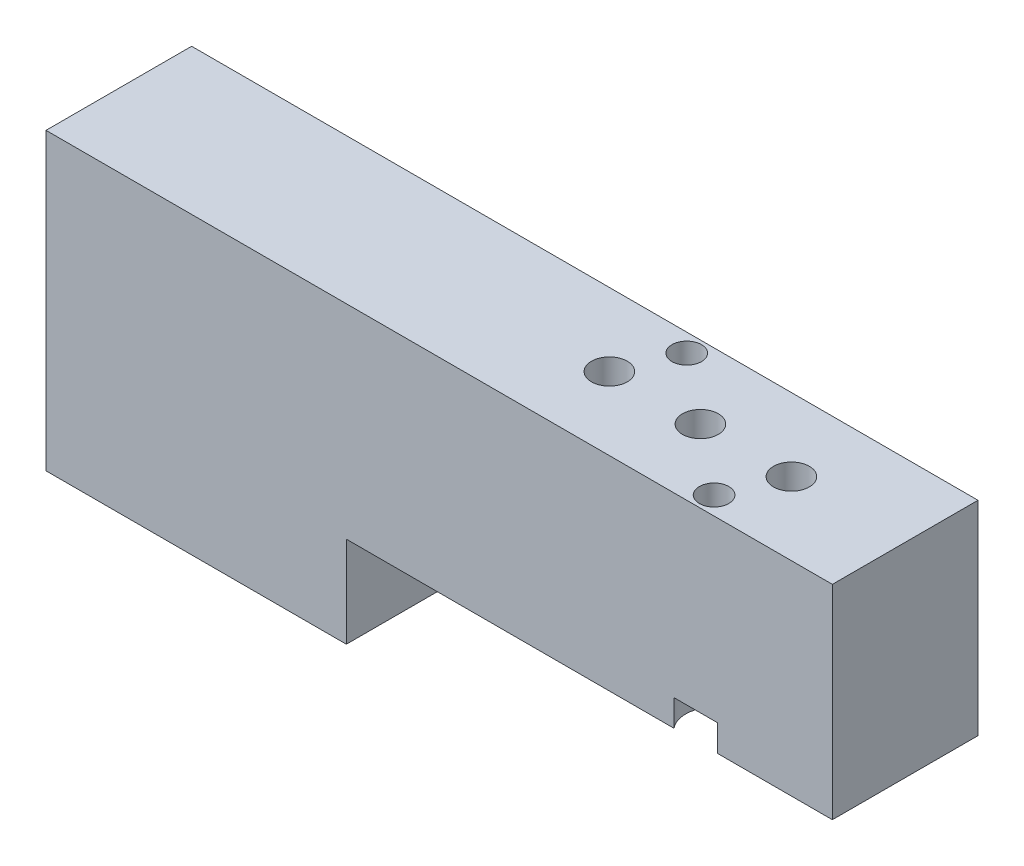
ISO-10303-21;
HEADER;
FILE_DESCRIPTION(('STEP AP214'),'2;1');
FILE_NAME('part.step','',(''),(''),'','','');
FILE_SCHEMA(('AUTOMOTIVE_DESIGN { 1 0 10303 214 1 1 1 1 }'));
ENDSEC;
DATA;
#1=APPLICATION_CONTEXT('core data for automotive mechanical design processes');
#2=APPLICATION_PROTOCOL_DEFINITION('international standard','automotive_design',2000,#1);
#3=PRODUCT_CONTEXT('',#1,'mechanical');
#4=PRODUCT('Part','Part','',(#3));
#5=PRODUCT_RELATED_PRODUCT_CATEGORY('part','',(#4));
#6=PRODUCT_DEFINITION_FORMATION('','',#4);
#7=PRODUCT_DEFINITION_CONTEXT('part definition',#1,'design');
#8=PRODUCT_DEFINITION('design','',#6,#7);
#9=PRODUCT_DEFINITION_SHAPE('','',#8);
#10=(LENGTH_UNIT() NAMED_UNIT(*) SI_UNIT(.MILLI.,.METRE.));
#11=(NAMED_UNIT(*) PLANE_ANGLE_UNIT() SI_UNIT($,.RADIAN.));
#12=(NAMED_UNIT(*) SI_UNIT($,.STERADIAN.) SOLID_ANGLE_UNIT());
#13=UNCERTAINTY_MEASURE_WITH_UNIT(LENGTH_MEASURE(1.E-05),#10,'distance_accuracy_value','');
#14=(GEOMETRIC_REPRESENTATION_CONTEXT(3) GLOBAL_UNCERTAINTY_ASSIGNED_CONTEXT((#13)) GLOBAL_UNIT_ASSIGNED_CONTEXT((#10,
#11,#12)) REPRESENTATION_CONTEXT('',''));
#15=CARTESIAN_POINT('',(0.,0.,0.));
#16=DIRECTION('',(0.,0.,1.));
#17=DIRECTION('',(1.,0.,0.));
#18=AXIS2_PLACEMENT_3D('',#15,#16,#17);
#19=CARTESIAN_POINT('',(0.,0.,-10.16));
#20=DIRECTION('',(-1.,0.,0.));
#21=DIRECTION('',(0.,0.,1.));
#22=AXIS2_PLACEMENT_3D('',#19,#20,#21);
#23=PLANE('',#22);
#24=DIRECTION('',(0.,-1.,0.));
#25=VECTOR('',#24,1.);
#26=CARTESIAN_POINT('',(0.,0.,0.));
#27=LINE('',#26,#25);
#28=CARTESIAN_POINT('',(0.,14.224,0.));
#29=VERTEX_POINT('',#28);
#30=CARTESIAN_POINT('',(0.,-6.35,0.));
#31=VERTEX_POINT('',#30);
#32=EDGE_CURVE('E195',#29,#31,#27,.T.);
#33=ORIENTED_EDGE('',*,*,#32,.F.);
#34=DIRECTION('',(0.,0.,1.));
#35=VECTOR('',#34,1.);
#36=CARTESIAN_POINT('',(0.,14.224,-10.16));
#37=LINE('',#36,#35);
#38=CARTESIAN_POINT('',(0.,14.224,-10.16));
#39=VERTEX_POINT('',#38);
#40=EDGE_CURVE('E215',#39,#29,#37,.T.);
#41=ORIENTED_EDGE('',*,*,#40,.F.);
#42=DIRECTION('',(0.,-1.,0.));
#43=VECTOR('',#42,1.);
#44=CARTESIAN_POINT('',(0.,0.,-10.16));
#45=LINE('',#44,#43);
#46=CARTESIAN_POINT('',(0.,-6.35,-10.16));
#47=VERTEX_POINT('',#46);
#48=EDGE_CURVE('E200',#39,#47,#45,.T.);
#49=ORIENTED_EDGE('',*,*,#48,.T.);
#50=DIRECTION('',(0.,0.,-1.));
#51=VECTOR('',#50,1.);
#52=CARTESIAN_POINT('',(0.,-6.35,0.));
#53=LINE('',#52,#51);
#54=EDGE_CURVE('E177',#31,#47,#53,.T.);
#55=ORIENTED_EDGE('',*,*,#54,.F.);
#56=EDGE_LOOP('',(#33,#41,#49,#55));
#57=FACE_BOUND('',#56,.T.);
#58=ADVANCED_FACE('F33',(#57),#23,.T.);
#59=CARTESIAN_POINT('',(0.,14.224,-10.16));
#60=DIRECTION('',(0.,1.,0.));
#61=DIRECTION('',(-1.,0.,0.));
#62=AXIS2_PLACEMENT_3D('',#59,#60,#61);
#63=PLANE('',#62);
#64=CARTESIAN_POINT('',(45.339,14.224,-1.27));
#65=DIRECTION('',(0.,1.,0.));
#66=DIRECTION('',(-1.,0.,0.));
#67=AXIS2_PLACEMENT_3D('',#64,#65,#66);
#68=CIRCLE('',#67,1.02869999999999);
#69=CARTESIAN_POINT('',(44.3103,14.224,-1.27));
#70=VERTEX_POINT('',#69);
#71=EDGE_CURVE('E36',#70,#70,#68,.T.);
#72=ORIENTED_EDGE('',*,*,#71,.F.);
#73=EDGE_LOOP('',(#72));
#74=FACE_BOUND('',#73,.T.);
#75=CARTESIAN_POINT('',(35.814,14.224,-8.89));
#76=DIRECTION('',(0.,1.,0.));
#77=DIRECTION('',(-1.,0.,0.));
#78=AXIS2_PLACEMENT_3D('',#75,#76,#77);
#79=CIRCLE('',#78,1.02869999999999);
#80=CARTESIAN_POINT('',(34.7853,14.224,-8.89));
#81=VERTEX_POINT('',#80);
#82=EDGE_CURVE('E155',#81,#81,#79,.T.);
#83=ORIENTED_EDGE('',*,*,#82,.F.);
#84=EDGE_LOOP('',(#83));
#85=FACE_BOUND('',#84,.T.);
#86=CARTESIAN_POINT('',(46.9265,14.224,-5.08));
#87=DIRECTION('',(0.,1.,0.));
#88=DIRECTION('',(0.,0.,1.));
#89=AXIS2_PLACEMENT_3D('',#86,#87,#88);
#90=CIRCLE('',#89,1.25);
#91=CARTESIAN_POINT('',(46.9265,14.224,-3.83));
#92=VERTEX_POINT('',#91);
#93=EDGE_CURVE('E159',#92,#92,#90,.T.);
#94=ORIENTED_EDGE('',*,*,#93,.F.);
#95=EDGE_LOOP('',(#94));
#96=FACE_BOUND('',#95,.T.);
#97=CARTESIAN_POINT('',(40.5765,14.224,-5.08));
#98=DIRECTION('',(0.,1.,0.));
#99=DIRECTION('',(0.,0.,1.));
#100=AXIS2_PLACEMENT_3D('',#97,#98,#99);
#101=CIRCLE('',#100,1.25);
#102=CARTESIAN_POINT('',(40.5765,14.224,-3.83));
#103=VERTEX_POINT('',#102);
#104=EDGE_CURVE('E165',#103,#103,#101,.T.);
#105=ORIENTED_EDGE('',*,*,#104,.F.);
#106=EDGE_LOOP('',(#105));
#107=FACE_BOUND('',#106,.T.);
#108=CARTESIAN_POINT('',(34.2265,14.224,-5.08));
#109=DIRECTION('',(0.,1.,0.));
#110=DIRECTION('',(0.,0.,1.));
#111=AXIS2_PLACEMENT_3D('',#108,#109,#110);
#112=CIRCLE('',#111,1.25);
#113=CARTESIAN_POINT('',(34.2265,14.224,-3.83));
#114=VERTEX_POINT('',#113);
#115=EDGE_CURVE('E171',#114,#114,#112,.T.);
#116=ORIENTED_EDGE('',*,*,#115,.F.);
#117=EDGE_LOOP('',(#116));
#118=FACE_BOUND('',#117,.T.);
#119=DIRECTION('',(-1.,0.,0.));
#120=VECTOR('',#119,1.);
#121=CARTESIAN_POINT('',(0.,14.224,0.));
#122=LINE('',#121,#120);
#123=CARTESIAN_POINT('',(54.864,14.224,0.));
#124=VERTEX_POINT('',#123);
#125=EDGE_CURVE('E252',#124,#29,#122,.T.);
#126=ORIENTED_EDGE('',*,*,#125,.F.);
#127=DIRECTION('',(0.,0.,1.));
#128=VECTOR('',#127,1.);
#129=CARTESIAN_POINT('',(54.864,14.224,-10.16));
#130=LINE('',#129,#128);
#131=CARTESIAN_POINT('',(54.864,14.224,-10.16));
#132=VERTEX_POINT('',#131);
#133=EDGE_CURVE('E217',#132,#124,#130,.T.);
#134=ORIENTED_EDGE('',*,*,#133,.F.);
#135=DIRECTION('',(-1.,0.,0.));
#136=VECTOR('',#135,1.);
#137=CARTESIAN_POINT('',(0.,14.224,-10.16));
#138=LINE('',#137,#136);
#139=EDGE_CURVE('E211',#132,#39,#138,.T.);
#140=ORIENTED_EDGE('',*,*,#139,.T.);
#141=ORIENTED_EDGE('',*,*,#40,.T.);
#142=EDGE_LOOP('',(#126,#134,#140,#141));
#143=FACE_BOUND('',#142,.T.);
#144=ADVANCED_FACE('F255',(#74,#85,#96,#107,#118,#143),#63,.T.);
#145=CARTESIAN_POINT('',(54.864,0.,-10.16));
#146=DIRECTION('',(1.,0.,0.));
#147=DIRECTION('',(0.,0.,-1.));
#148=AXIS2_PLACEMENT_3D('',#145,#146,#147);
#149=PLANE('',#148);
#150=DIRECTION('',(0.,1.,0.));
#151=VECTOR('',#150,1.);
#152=CARTESIAN_POINT('',(54.864,0.,0.));
#153=LINE('',#152,#151);
#154=CARTESIAN_POINT('',(54.864,0.,0.));
#155=VERTEX_POINT('',#154);
#156=EDGE_CURVE('E223',#155,#124,#153,.T.);
#157=ORIENTED_EDGE('',*,*,#156,.F.);
#158=DIRECTION('',(0.,0.,1.));
#159=VECTOR('',#158,1.);
#160=CARTESIAN_POINT('',(54.864,0.,-10.16));
#161=LINE('',#160,#159);
#162=CARTESIAN_POINT('',(54.864,0.,-10.16));
#163=VERTEX_POINT('',#162);
#164=EDGE_CURVE('E214',#163,#155,#161,.T.);
#165=ORIENTED_EDGE('',*,*,#164,.F.);
#166=DIRECTION('',(0.,1.,0.));
#167=VECTOR('',#166,1.);
#168=CARTESIAN_POINT('',(54.864,0.,-10.16));
#169=LINE('',#168,#167);
#170=EDGE_CURVE('E207',#163,#132,#169,.T.);
#171=ORIENTED_EDGE('',*,*,#170,.T.);
#172=ORIENTED_EDGE('',*,*,#133,.T.);
#173=EDGE_LOOP('',(#157,#165,#171,#172));
#174=FACE_BOUND('',#173,.T.);
#175=ADVANCED_FACE('F290',(#174),#149,.T.);
#176=CARTESIAN_POINT('',(0.,0.,-10.16));
#177=DIRECTION('',(0.,-1.,0.));
#178=DIRECTION('',(0.,0.,-1.));
#179=AXIS2_PLACEMENT_3D('',#176,#177,#178);
#180=PLANE('',#179);
#181=CARTESIAN_POINT('',(43.7642,0.,-6.985));
#182=DIRECTION('',(0.,-1.,0.));
#183=DIRECTION('',(0.,0.,-1.));
#184=AXIS2_PLACEMENT_3D('',#181,#182,#183);
#185=CIRCLE('',#184,1.24999999999999);
#186=CARTESIAN_POINT('',(43.7642,0.,-8.23499999999999));
#187=VERTEX_POINT('',#186);
#188=EDGE_CURVE('E132',#187,#187,#185,.T.);
#189=ORIENTED_EDGE('',*,*,#188,.F.);
#190=EDGE_LOOP('',(#189));
#191=FACE_BOUND('',#190,.T.);
#192=CARTESIAN_POINT('',(37.4142,0.,-3.175));
#193=DIRECTION('',(0.,-1.,0.));
#194=DIRECTION('',(0.,0.,-1.));
#195=AXIS2_PLACEMENT_3D('',#192,#193,#194);
#196=CIRCLE('',#195,1.24999999999999);
#197=CARTESIAN_POINT('',(37.4142,0.,-4.42499999999999));
#198=VERTEX_POINT('',#197);
#199=EDGE_CURVE('E140',#198,#198,#196,.T.);
#200=ORIENTED_EDGE('',*,*,#199,.F.);
#201=EDGE_LOOP('',(#200));
#202=FACE_BOUND('',#201,.T.);
#203=CARTESIAN_POINT('',(45.339,0.,-1.27));
#204=DIRECTION('',(0.,-1.,0.));
#205=DIRECTION('',(0.,0.,-1.));
#206=AXIS2_PLACEMENT_3D('',#203,#204,#205);
#207=CIRCLE('',#206,1.98501);
#208=CARTESIAN_POINT('',(43.8134297131564,0.,0.));
#209=VERTEX_POINT('',#208);
#210=CARTESIAN_POINT('',(46.8645702868436,0.,0.));
#211=VERTEX_POINT('',#210);
#212=EDGE_CURVE('E147',#209,#211,#207,.T.);
#213=ORIENTED_EDGE('',*,*,#212,.F.);
#214=DIRECTION('',(1.,0.,0.));
#215=VECTOR('',#214,1.);
#216=CARTESIAN_POINT('',(0.,0.,0.));
#217=LINE('',#216,#215);
#218=CARTESIAN_POINT('',(20.955,0.,0.));
#219=VERTEX_POINT('',#218);
#220=EDGE_CURVE('E220',#219,#209,#217,.T.);
#221=ORIENTED_EDGE('',*,*,#220,.F.);
#222=DIRECTION('',(0.,0.,1.));
#223=VECTOR('',#222,1.);
#224=CARTESIAN_POINT('',(20.955,0.,0.));
#225=LINE('',#224,#223);
#226=CARTESIAN_POINT('',(20.955,0.,-10.16));
#227=VERTEX_POINT('',#226);
#228=EDGE_CURVE('E174',#227,#219,#225,.T.);
#229=ORIENTED_EDGE('',*,*,#228,.F.);
#230=DIRECTION('',(1.,0.,0.));
#231=VECTOR('',#230,1.);
#232=CARTESIAN_POINT('',(0.,0.,-10.16));
#233=LINE('',#232,#231);
#234=CARTESIAN_POINT('',(34.2884297131564,0.,-10.16));
#235=VERTEX_POINT('',#234);
#236=EDGE_CURVE('E183',#227,#235,#233,.T.);
#237=ORIENTED_EDGE('',*,*,#236,.T.);
#238=CARTESIAN_POINT('',(35.814,0.,-8.89));
#239=DIRECTION('',(0.,-1.,0.));
#240=DIRECTION('',(0.,0.,-1.));
#241=AXIS2_PLACEMENT_3D('',#238,#239,#240);
#242=CIRCLE('',#241,1.98501);
#243=CARTESIAN_POINT('',(37.3395702868436,0.,-10.16));
#244=VERTEX_POINT('',#243);
#245=EDGE_CURVE('E153',#244,#235,#242,.T.);
#246=ORIENTED_EDGE('',*,*,#245,.F.);
#247=EDGE_CURVE('E198',#244,#163,#233,.T.);
#248=ORIENTED_EDGE('',*,*,#247,.T.);
#249=ORIENTED_EDGE('',*,*,#164,.T.);
#250=EDGE_CURVE('E224',#211,#155,#217,.T.);
#251=ORIENTED_EDGE('',*,*,#250,.F.);
#252=EDGE_LOOP('',(#213,#221,#229,#237,#246,#248,#249,#251));
#253=FACE_BOUND('',#252,.T.);
#254=ADVANCED_FACE('F246',(#191,#202,#253),#180,.T.);
#255=CARTESIAN_POINT('',(0.,0.,-10.16));
#256=DIRECTION('',(0.,0.,-1.));
#257=DIRECTION('',(-1.,0.,0.));
#258=AXIS2_PLACEMENT_3D('',#255,#256,#257);
#259=PLANE('',#258);
#260=DIRECTION('',(0.,-1.,0.));
#261=VECTOR('',#260,1.);
#262=CARTESIAN_POINT('',(37.3395702868436,0.,-10.16));
#263=LINE('',#262,#261);
#264=CARTESIAN_POINT('',(37.3395702868436,1.8542,-10.16));
#265=VERTEX_POINT('',#264);
#266=EDGE_CURVE('E237',#265,#244,#263,.T.);
#267=ORIENTED_EDGE('',*,*,#266,.F.);
#268=DIRECTION('',(1.,0.,0.));
#269=VECTOR('',#268,1.);
#270=CARTESIAN_POINT('',(0.,1.8542,-10.16));
#271=LINE('',#270,#269);
#272=CARTESIAN_POINT('',(34.2884297131564,1.8542,-10.16));
#273=VERTEX_POINT('',#272);
#274=EDGE_CURVE('E201',#273,#265,#271,.T.);
#275=ORIENTED_EDGE('',*,*,#274,.F.);
#276=DIRECTION('',(0.,-1.,0.));
#277=VECTOR('',#276,1.);
#278=CARTESIAN_POINT('',(34.2884297131564,0.,-10.16));
#279=LINE('',#278,#277);
#280=EDGE_CURVE('E283',#235,#273,#279,.F.);
#281=ORIENTED_EDGE('',*,*,#280,.F.);
#282=ORIENTED_EDGE('',*,*,#236,.F.);
#283=DIRECTION('',(0.,1.,0.));
#284=VECTOR('',#283,1.);
#285=CARTESIAN_POINT('',(20.955,-6.35,-10.16));
#286=LINE('',#285,#284);
#287=CARTESIAN_POINT('',(20.955,-6.35,-10.16));
#288=VERTEX_POINT('',#287);
#289=EDGE_CURVE('E189',#288,#227,#286,.T.);
#290=ORIENTED_EDGE('',*,*,#289,.F.);
#291=DIRECTION('',(1.,0.,0.));
#292=VECTOR('',#291,1.);
#293=CARTESIAN_POINT('',(0.,-6.35,-10.16));
#294=LINE('',#293,#292);
#295=EDGE_CURVE('E265',#47,#288,#294,.T.);
#296=ORIENTED_EDGE('',*,*,#295,.F.);
#297=ORIENTED_EDGE('',*,*,#48,.F.);
#298=ORIENTED_EDGE('',*,*,#139,.F.);
#299=ORIENTED_EDGE('',*,*,#170,.F.);
#300=ORIENTED_EDGE('',*,*,#247,.F.);
#301=EDGE_LOOP('',(#267,#275,#281,#282,#290,#296,#297,#298,#299,#300));
#302=FACE_BOUND('',#301,.T.);
#303=ADVANCED_FACE('F267',(#302),#259,.T.);
#304=CARTESIAN_POINT('',(0.,0.,0.));
#305=DIRECTION('',(0.,0.,-1.));
#306=DIRECTION('',(-1.,0.,0.));
#307=AXIS2_PLACEMENT_3D('',#304,#305,#306);
#308=PLANE('',#307);
#309=DIRECTION('',(1.,0.,0.));
#310=VECTOR('',#309,1.);
#311=CARTESIAN_POINT('',(0.,1.8542,0.));
#312=LINE('',#311,#310);
#313=CARTESIAN_POINT('',(43.8134297131564,1.8542,0.));
#314=VERTEX_POINT('',#313);
#315=CARTESIAN_POINT('',(46.8645702868436,1.8542,0.));
#316=VERTEX_POINT('',#315);
#317=EDGE_CURVE('E234',#314,#316,#312,.T.);
#318=ORIENTED_EDGE('',*,*,#317,.T.);
#319=DIRECTION('',(0.,-1.,0.));
#320=VECTOR('',#319,1.);
#321=CARTESIAN_POINT('',(46.8645702868436,0.,0.));
#322=LINE('',#321,#320);
#323=EDGE_CURVE('E11',#316,#211,#322,.T.);
#324=ORIENTED_EDGE('',*,*,#323,.T.);
#325=ORIENTED_EDGE('',*,*,#250,.T.);
#326=ORIENTED_EDGE('',*,*,#156,.T.);
#327=ORIENTED_EDGE('',*,*,#125,.T.);
#328=ORIENTED_EDGE('',*,*,#32,.T.);
#329=DIRECTION('',(-1.,0.,0.));
#330=VECTOR('',#329,1.);
#331=CARTESIAN_POINT('',(0.,-6.35,0.));
#332=LINE('',#331,#330);
#333=CARTESIAN_POINT('',(20.955,-6.35,0.));
#334=VERTEX_POINT('',#333);
#335=EDGE_CURVE('E190',#334,#31,#332,.T.);
#336=ORIENTED_EDGE('',*,*,#335,.F.);
#337=DIRECTION('',(0.,1.,0.));
#338=VECTOR('',#337,1.);
#339=CARTESIAN_POINT('',(20.955,-6.35,0.));
#340=LINE('',#339,#338);
#341=EDGE_CURVE('E186',#334,#219,#340,.T.);
#342=ORIENTED_EDGE('',*,*,#341,.T.);
#343=ORIENTED_EDGE('',*,*,#220,.T.);
#344=DIRECTION('',(0.,-1.,0.));
#345=VECTOR('',#344,1.);
#346=CARTESIAN_POINT('',(43.8134297131564,0.,0.));
#347=LINE('',#346,#345);
#348=EDGE_CURVE('E41',#209,#314,#347,.F.);
#349=ORIENTED_EDGE('',*,*,#348,.T.);
#350=EDGE_LOOP('',(#318,#324,#325,#326,#327,#328,#336,#342,#343,#349));
#351=FACE_BOUND('',#350,.T.);
#352=ADVANCED_FACE('F240',(#351),#308,.F.);
#353=CARTESIAN_POINT('',(20.955,-6.35,0.));
#354=DIRECTION('',(-1.,0.,0.));
#355=DIRECTION('',(0.,0.,1.));
#356=AXIS2_PLACEMENT_3D('',#353,#354,#355);
#357=PLANE('',#356);
#358=ORIENTED_EDGE('',*,*,#228,.T.);
#359=ORIENTED_EDGE('',*,*,#341,.F.);
#360=DIRECTION('',(0.,0.,1.));
#361=VECTOR('',#360,1.);
#362=CARTESIAN_POINT('',(20.955,-6.35,0.));
#363=LINE('',#362,#361);
#364=EDGE_CURVE('E271',#288,#334,#363,.T.);
#365=ORIENTED_EDGE('',*,*,#364,.F.);
#366=ORIENTED_EDGE('',*,*,#289,.T.);
#367=EDGE_LOOP('',(#358,#359,#365,#366));
#368=FACE_BOUND('',#367,.T.);
#369=ADVANCED_FACE('F278',(#368),#357,.F.);
#370=CARTESIAN_POINT('',(0.,-6.35,-10.16));
#371=DIRECTION('',(0.,-1.,0.));
#372=DIRECTION('',(0.,0.,-1.));
#373=AXIS2_PLACEMENT_3D('',#370,#371,#372);
#374=PLANE('',#373);
#375=ORIENTED_EDGE('',*,*,#54,.T.);
#376=ORIENTED_EDGE('',*,*,#295,.T.);
#377=ORIENTED_EDGE('',*,*,#364,.T.);
#378=ORIENTED_EDGE('',*,*,#335,.T.);
#379=EDGE_LOOP('',(#375,#376,#377,#378));
#380=FACE_BOUND('',#379,.T.);
#381=ADVANCED_FACE('F273',(#380),#374,.T.);
#382=CARTESIAN_POINT('',(34.2265,14.224,-5.08));
#383=DIRECTION('',(0.,1.,0.));
#384=DIRECTION('',(0.,0.,1.));
#385=AXIS2_PLACEMENT_3D('',#382,#383,#384);
#386=CYLINDRICAL_SURFACE('',#385,1.25);
#387=CARTESIAN_POINT('',(34.2265,6.724015,-5.08));
#388=DIRECTION('',(0.,1.,0.));
#389=DIRECTION('',(0.,0.,1.));
#390=AXIS2_PLACEMENT_3D('',#387,#388,#389);
#391=CIRCLE('',#390,1.25);
#392=CARTESIAN_POINT('',(34.2265,6.724015,-3.83));
#393=VERTEX_POINT('',#392);
#394=EDGE_CURVE('E168',#393,#393,#391,.T.);
#395=ORIENTED_EDGE('',*,*,#394,.F.);
#396=EDGE_LOOP('',(#395));
#397=FACE_BOUND('',#396,.T.);
#398=ORIENTED_EDGE('',*,*,#115,.T.);
#399=EDGE_LOOP('',(#398));
#400=FACE_BOUND('',#399,.T.);
#401=ADVANCED_FACE('F319',(#397,#400),#386,.F.);
#402=CARTESIAN_POINT('',(34.2265,6.724015,-5.08));
#403=DIRECTION('',(0.,1.,0.));
#404=DIRECTION('',(0.,0.,1.));
#405=AXIS2_PLACEMENT_3D('',#402,#403,#404);
#406=CONICAL_SURFACE('',#405,1.25,1.02974425867665);
#407=CARTESIAN_POINT('',(34.2265,5.97293922621555,-5.08));
#408=VERTEX_POINT('',#407);
#409=VERTEX_LOOP('',#408);
#410=FACE_BOUND('',#409,.T.);
#411=ORIENTED_EDGE('',*,*,#394,.T.);
#412=EDGE_LOOP('',(#411));
#413=FACE_BOUND('',#412,.T.);
#414=ADVANCED_FACE('F327',(#410,#413),#406,.F.);
#415=CARTESIAN_POINT('',(40.5765,14.224,-5.08));
#416=DIRECTION('',(0.,1.,0.));
#417=DIRECTION('',(0.,0.,1.));
#418=AXIS2_PLACEMENT_3D('',#415,#416,#417);
#419=CYLINDRICAL_SURFACE('',#418,1.25);
#420=CARTESIAN_POINT('',(40.5765,6.724015,-5.08));
#421=DIRECTION('',(0.,1.,0.));
#422=DIRECTION('',(0.,0.,1.));
#423=AXIS2_PLACEMENT_3D('',#420,#421,#422);
#424=CIRCLE('',#423,1.25);
#425=CARTESIAN_POINT('',(40.5765,6.724015,-3.83));
#426=VERTEX_POINT('',#425);
#427=EDGE_CURVE('E162',#426,#426,#424,.T.);
#428=ORIENTED_EDGE('',*,*,#427,.F.);
#429=EDGE_LOOP('',(#428));
#430=FACE_BOUND('',#429,.T.);
#431=ORIENTED_EDGE('',*,*,#104,.T.);
#432=EDGE_LOOP('',(#431));
#433=FACE_BOUND('',#432,.T.);
#434=ADVANCED_FACE('F337',(#430,#433),#419,.F.);
#435=CARTESIAN_POINT('',(40.5765,6.724015,-5.08));
#436=DIRECTION('',(0.,1.,0.));
#437=DIRECTION('',(0.,0.,1.));
#438=AXIS2_PLACEMENT_3D('',#435,#436,#437);
#439=CONICAL_SURFACE('',#438,1.25,1.02974425867665);
#440=CARTESIAN_POINT('',(40.5765,5.97293922621555,-5.08));
#441=VERTEX_POINT('',#440);
#442=VERTEX_LOOP('',#441);
#443=FACE_BOUND('',#442,.T.);
#444=ORIENTED_EDGE('',*,*,#427,.T.);
#445=EDGE_LOOP('',(#444));
#446=FACE_BOUND('',#445,.T.);
#447=ADVANCED_FACE('F345',(#443,#446),#439,.F.);
#448=CARTESIAN_POINT('',(46.9265,14.224,-5.08));
#449=DIRECTION('',(0.,1.,0.));
#450=DIRECTION('',(0.,0.,1.));
#451=AXIS2_PLACEMENT_3D('',#448,#449,#450);
#452=CYLINDRICAL_SURFACE('',#451,1.25);
#453=CARTESIAN_POINT('',(46.9265,6.724015,-5.08));
#454=DIRECTION('',(0.,1.,0.));
#455=DIRECTION('',(0.,0.,1.));
#456=AXIS2_PLACEMENT_3D('',#453,#454,#455);
#457=CIRCLE('',#456,1.25);
#458=CARTESIAN_POINT('',(46.9265,6.724015,-3.83));
#459=VERTEX_POINT('',#458);
#460=EDGE_CURVE('E156',#459,#459,#457,.T.);
#461=ORIENTED_EDGE('',*,*,#460,.F.);
#462=EDGE_LOOP('',(#461));
#463=FACE_BOUND('',#462,.T.);
#464=ORIENTED_EDGE('',*,*,#93,.T.);
#465=EDGE_LOOP('',(#464));
#466=FACE_BOUND('',#465,.T.);
#467=ADVANCED_FACE('F355',(#463,#466),#452,.F.);
#468=CARTESIAN_POINT('',(46.9265,6.724015,-5.08));
#469=DIRECTION('',(0.,1.,0.));
#470=DIRECTION('',(0.,0.,1.));
#471=AXIS2_PLACEMENT_3D('',#468,#469,#470);
#472=CONICAL_SURFACE('',#471,1.25,1.02974425867665);
#473=CARTESIAN_POINT('',(46.9265,5.97293922621555,-5.08));
#474=VERTEX_POINT('',#473);
#475=VERTEX_LOOP('',#474);
#476=FACE_BOUND('',#475,.T.);
#477=ORIENTED_EDGE('',*,*,#460,.T.);
#478=EDGE_LOOP('',(#477));
#479=FACE_BOUND('',#478,.T.);
#480=ADVANCED_FACE('F363',(#476,#479),#472,.F.);
#481=CARTESIAN_POINT('',(35.814,0.,-8.89));
#482=DIRECTION('',(0.,-1.,0.));
#483=DIRECTION('',(0.,0.,-1.));
#484=AXIS2_PLACEMENT_3D('',#481,#482,#483);
#485=CYLINDRICAL_SURFACE('',#484,1.98501);
#486=ORIENTED_EDGE('',*,*,#266,.T.);
#487=ORIENTED_EDGE('',*,*,#245,.T.);
#488=ORIENTED_EDGE('',*,*,#280,.T.);
#489=CARTESIAN_POINT('',(35.814,1.8542,-8.89));
#490=DIRECTION('',(0.,-1.,0.));
#491=DIRECTION('',(0.,0.,-1.));
#492=AXIS2_PLACEMENT_3D('',#489,#490,#491);
#493=CIRCLE('',#492,1.98501);
#494=EDGE_CURVE('E54',#265,#273,#493,.T.);
#495=ORIENTED_EDGE('',*,*,#494,.F.);
#496=EDGE_LOOP('',(#486,#487,#488,#495));
#497=FACE_BOUND('',#496,.T.);
#498=ADVANCED_FACE('F287',(#497),#485,.F.);
#499=CARTESIAN_POINT('',(36.8427,1.8542,-8.89));
#500=DIRECTION('',(0.,1.,0.));
#501=DIRECTION('',(0.,0.,1.));
#502=AXIS2_PLACEMENT_3D('',#499,#500,#501);
#503=PLANE('',#502);
#504=ORIENTED_EDGE('',*,*,#274,.T.);
#505=ORIENTED_EDGE('',*,*,#494,.T.);
#506=EDGE_LOOP('',(#504,#505));
#507=FACE_BOUND('',#506,.T.);
#508=CARTESIAN_POINT('',(35.814,1.8542,-8.89));
#509=DIRECTION('',(0.,-1.,0.));
#510=DIRECTION('',(0.,0.,-1.));
#511=AXIS2_PLACEMENT_3D('',#508,#509,#510);
#512=CIRCLE('',#511,1.02869999999999);
#513=CARTESIAN_POINT('',(35.814,1.8542,-9.91869999999999));
#514=VERTEX_POINT('',#513);
#515=EDGE_CURVE('E149',#514,#514,#512,.T.);
#516=ORIENTED_EDGE('',*,*,#515,.F.);
#517=EDGE_LOOP('',(#516));
#518=FACE_BOUND('',#517,.T.);
#519=ADVANCED_FACE('F285',(#507,#518),#503,.F.);
#520=CARTESIAN_POINT('',(35.814,0.,-8.89));
#521=DIRECTION('',(0.,-1.,0.));
#522=DIRECTION('',(0.,0.,-1.));
#523=AXIS2_PLACEMENT_3D('',#520,#521,#522);
#524=CYLINDRICAL_SURFACE('',#523,1.02869999999999);
#525=ORIENTED_EDGE('',*,*,#82,.T.);
#526=EDGE_LOOP('',(#525));
#527=FACE_BOUND('',#526,.T.);
#528=ORIENTED_EDGE('',*,*,#515,.T.);
#529=EDGE_LOOP('',(#528));
#530=FACE_BOUND('',#529,.T.);
#531=ADVANCED_FACE('F401',(#527,#530),#524,.F.);
#532=CARTESIAN_POINT('',(45.339,0.,-1.27));
#533=DIRECTION('',(0.,-1.,0.));
#534=DIRECTION('',(0.,0.,-1.));
#535=AXIS2_PLACEMENT_3D('',#532,#533,#534);
#536=CYLINDRICAL_SURFACE('',#535,1.98501);
#537=CARTESIAN_POINT('',(45.339,1.8542,-1.27));
#538=DIRECTION('',(0.,-1.,0.));
#539=DIRECTION('',(0.,0.,-1.));
#540=AXIS2_PLACEMENT_3D('',#537,#538,#539);
#541=CIRCLE('',#540,1.98501);
#542=EDGE_CURVE('E47',#314,#316,#541,.T.);
#543=ORIENTED_EDGE('',*,*,#542,.F.);
#544=ORIENTED_EDGE('',*,*,#348,.F.);
#545=ORIENTED_EDGE('',*,*,#212,.T.);
#546=ORIENTED_EDGE('',*,*,#323,.F.);
#547=EDGE_LOOP('',(#543,#544,#545,#546));
#548=FACE_BOUND('',#547,.T.);
#549=ADVANCED_FACE('F243',(#548),#536,.F.);
#550=CARTESIAN_POINT('',(46.3677,1.8542,-1.27));
#551=DIRECTION('',(0.,1.,0.));
#552=DIRECTION('',(0.,0.,1.));
#553=AXIS2_PLACEMENT_3D('',#550,#551,#552);
#554=PLANE('',#553);
#555=CARTESIAN_POINT('',(45.339,1.8542,-1.27));
#556=DIRECTION('',(0.,-1.,0.));
#557=DIRECTION('',(0.,0.,-1.));
#558=AXIS2_PLACEMENT_3D('',#555,#556,#557);
#559=CIRCLE('',#558,1.02869999999999);
#560=CARTESIAN_POINT('',(45.339,1.8542,-2.29869999999999));
#561=VERTEX_POINT('',#560);
#562=EDGE_CURVE('E143',#561,#561,#559,.T.);
#563=ORIENTED_EDGE('',*,*,#562,.F.);
#564=EDGE_LOOP('',(#563));
#565=FACE_BOUND('',#564,.T.);
#566=ORIENTED_EDGE('',*,*,#542,.T.);
#567=ORIENTED_EDGE('',*,*,#317,.F.);
#568=EDGE_LOOP('',(#566,#567));
#569=FACE_BOUND('',#568,.T.);
#570=ADVANCED_FACE('F415',(#565,#569),#554,.F.);
#571=CARTESIAN_POINT('',(45.339,0.,-1.27));
#572=DIRECTION('',(0.,-1.,0.));
#573=DIRECTION('',(0.,0.,-1.));
#574=AXIS2_PLACEMENT_3D('',#571,#572,#573);
#575=CYLINDRICAL_SURFACE('',#574,1.02869999999999);
#576=ORIENTED_EDGE('',*,*,#71,.T.);
#577=EDGE_LOOP('',(#576));
#578=FACE_BOUND('',#577,.T.);
#579=ORIENTED_EDGE('',*,*,#562,.T.);
#580=EDGE_LOOP('',(#579));
#581=FACE_BOUND('',#580,.T.);
#582=ADVANCED_FACE('F422',(#578,#581),#575,.F.);
#583=CARTESIAN_POINT('',(37.4142,0.,-3.175));
#584=DIRECTION('',(0.,-1.,0.));
#585=DIRECTION('',(0.,0.,-1.));
#586=AXIS2_PLACEMENT_3D('',#583,#584,#585);
#587=CYLINDRICAL_SURFACE('',#586,1.24999999999999);
#588=CARTESIAN_POINT('',(37.4142,7.5000104,-3.175));
#589=DIRECTION('',(0.,-1.,0.));
#590=DIRECTION('',(0.,0.,-1.));
#591=AXIS2_PLACEMENT_3D('',#588,#589,#590);
#592=CIRCLE('',#591,1.25);
#593=CARTESIAN_POINT('',(37.4142,7.5000104,-4.425));
#594=VERTEX_POINT('',#593);
#595=EDGE_CURVE('E135',#594,#594,#592,.T.);
#596=ORIENTED_EDGE('',*,*,#595,.F.);
#597=EDGE_LOOP('',(#596));
#598=FACE_BOUND('',#597,.T.);
#599=ORIENTED_EDGE('',*,*,#199,.T.);
#600=EDGE_LOOP('',(#599));
#601=FACE_BOUND('',#600,.T.);
#602=ADVANCED_FACE('F429',(#598,#601),#587,.F.);
#603=CARTESIAN_POINT('',(37.4142,7.5000104,-3.175));
#604=DIRECTION('',(0.,-1.,0.));
#605=DIRECTION('',(0.,0.,-1.));
#606=AXIS2_PLACEMENT_3D('',#603,#604,#605);
#607=CONICAL_SURFACE('',#606,1.25,1.02974425867665);
#608=CARTESIAN_POINT('',(37.4142,8.25108617378445,-3.175));
#609=VERTEX_POINT('',#608);
#610=VERTEX_LOOP('',#609);
#611=FACE_BOUND('',#610,.T.);
#612=ORIENTED_EDGE('',*,*,#595,.T.);
#613=EDGE_LOOP('',(#612));
#614=FACE_BOUND('',#613,.T.);
#615=ADVANCED_FACE('F442',(#611,#614),#607,.F.);
#616=CARTESIAN_POINT('',(43.7642,0.,-6.985));
#617=DIRECTION('',(0.,-1.,0.));
#618=DIRECTION('',(0.,0.,-1.));
#619=AXIS2_PLACEMENT_3D('',#616,#617,#618);
#620=CYLINDRICAL_SURFACE('',#619,1.24999999999999);
#621=CARTESIAN_POINT('',(43.7642,7.5000104,-6.985));
#622=DIRECTION('',(0.,-1.,0.));
#623=DIRECTION('',(0.,0.,-1.));
#624=AXIS2_PLACEMENT_3D('',#621,#622,#623);
#625=CIRCLE('',#624,1.25);
#626=CARTESIAN_POINT('',(43.7642,7.5000104,-8.235));
#627=VERTEX_POINT('',#626);
#628=EDGE_CURVE('E130',#627,#627,#625,.T.);
#629=ORIENTED_EDGE('',*,*,#628,.F.);
#630=EDGE_LOOP('',(#629));
#631=FACE_BOUND('',#630,.T.);
#632=ORIENTED_EDGE('',*,*,#188,.T.);
#633=EDGE_LOOP('',(#632));
#634=FACE_BOUND('',#633,.T.);
#635=ADVANCED_FACE('F126',(#631,#634),#620,.F.);
#636=CARTESIAN_POINT('',(43.7642,7.5000104,-6.985));
#637=DIRECTION('',(0.,-1.,0.));
#638=DIRECTION('',(0.,0.,-1.));
#639=AXIS2_PLACEMENT_3D('',#636,#637,#638);
#640=CONICAL_SURFACE('',#639,1.25,1.02974425867665);
#641=CARTESIAN_POINT('',(43.7642,8.25108617378445,-6.985));
#642=VERTEX_POINT('',#641);
#643=VERTEX_LOOP('',#642);
#644=FACE_BOUND('',#643,.T.);
#645=ORIENTED_EDGE('',*,*,#628,.T.);
#646=EDGE_LOOP('',(#645));
#647=FACE_BOUND('',#646,.T.);
#648=ADVANCED_FACE('F123',(#644,#647),#640,.F.);
#649=CLOSED_SHELL('',(#58,#144,#175,#254,#303,#352,#369,#381,#401,#414,#434,#447,#467,#480,#498,
#519,#531,#549,#570,#582,#602,#615,#635,#648));
#650=MANIFOLD_SOLID_BREP('B2',#649);
#651=ADVANCED_BREP_SHAPE_REPRESENTATION('',(#18,#650),#14);
#652=SHAPE_DEFINITION_REPRESENTATION(#9,#651);
ENDSEC;
END-ISO-10303-21;
